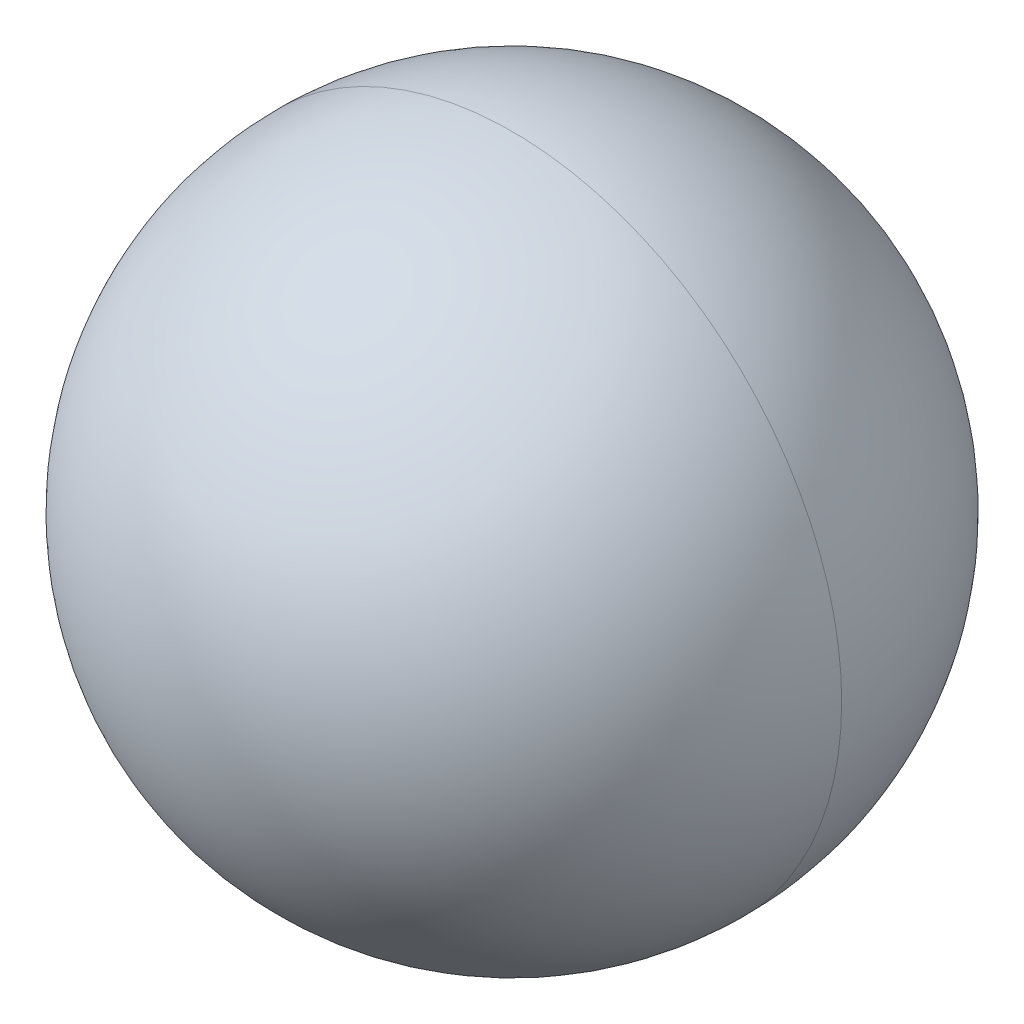
ISO-10303-21;
HEADER;
FILE_DESCRIPTION(('STEP AP214'),'2;1');
FILE_NAME('part.step','',(''),(''),'','','');
FILE_SCHEMA(('AUTOMOTIVE_DESIGN { 1 0 10303 214 1 1 1 1 }'));
ENDSEC;
DATA;
#1=APPLICATION_CONTEXT('core data for automotive mechanical design processes');
#2=APPLICATION_PROTOCOL_DEFINITION('international standard','automotive_design',2000,#1);
#3=PRODUCT_CONTEXT('',#1,'mechanical');
#4=PRODUCT('Part','Part','',(#3));
#5=PRODUCT_RELATED_PRODUCT_CATEGORY('part','',(#4));
#6=PRODUCT_DEFINITION_FORMATION('','',#4);
#7=PRODUCT_DEFINITION_CONTEXT('part definition',#1,'design');
#8=PRODUCT_DEFINITION('design','',#6,#7);
#9=PRODUCT_DEFINITION_SHAPE('','',#8);
#10=(LENGTH_UNIT() NAMED_UNIT(*) SI_UNIT(.MILLI.,.METRE.));
#11=(NAMED_UNIT(*) PLANE_ANGLE_UNIT() SI_UNIT($,.RADIAN.));
#12=(NAMED_UNIT(*) SI_UNIT($,.STERADIAN.) SOLID_ANGLE_UNIT());
#13=UNCERTAINTY_MEASURE_WITH_UNIT(LENGTH_MEASURE(1.E-05),#10,'distance_accuracy_value','');
#14=(GEOMETRIC_REPRESENTATION_CONTEXT(3) GLOBAL_UNCERTAINTY_ASSIGNED_CONTEXT((#13)) GLOBAL_UNIT_ASSIGNED_CONTEXT((#10,
#11,#12)) REPRESENTATION_CONTEXT('',''));
#15=CARTESIAN_POINT('',(0.,0.,0.));
#16=DIRECTION('',(0.,0.,1.));
#17=DIRECTION('',(1.,0.,0.));
#18=AXIS2_PLACEMENT_3D('',#15,#16,#17);
#19=CARTESIAN_POINT('',(6.,14.25,0.));
#20=DIRECTION('',(1.,0.,0.));
#21=DIRECTION('',(0.,0.,1.));
#22=AXIS2_PLACEMENT_3D('',#19,#20,#21);
#23=SPHERICAL_SURFACE('',#22,3.3735);
#24=CARTESIAN_POINT('',(6.,14.25,0.));
#25=DIRECTION('',(0.,0.,-1.));
#26=DIRECTION('',(1.,0.,0.));
#27=AXIS2_PLACEMENT_3D('',#24,#25,#26);
#28=CIRCLE('',#27,3.3735);
#29=CARTESIAN_POINT('',(9.3735,14.25,0.));
#30=VERTEX_POINT('',#29);
#31=CARTESIAN_POINT('',(2.6265,14.25,0.));
#32=VERTEX_POINT('',#31);
#33=EDGE_CURVE('E11',#30,#32,#28,.T.);
#34=ORIENTED_EDGE('',*,*,#33,.T.);
#35=CARTESIAN_POINT('',(6.,14.25,0.));
#36=DIRECTION('',(0.,0.,1.));
#37=DIRECTION('',(1.,0.,0.));
#38=AXIS2_PLACEMENT_3D('',#35,#36,#37);
#39=CIRCLE('',#38,3.3735);
#40=EDGE_CURVE('E25',#30,#32,#39,.T.);
#41=ORIENTED_EDGE('',*,*,#40,.F.);
#42=EDGE_LOOP('',(#34,#41));
#43=FACE_BOUND('',#42,.T.);
#44=ADVANCED_FACE('F17',(#43),#23,.T.);
#45=CARTESIAN_POINT('',(6.,14.25,0.));
#46=DIRECTION('',(1.,0.,0.));
#47=DIRECTION('',(0.,0.,-1.));
#48=AXIS2_PLACEMENT_3D('',#45,#46,#47);
#49=SPHERICAL_SURFACE('',#48,3.3735);
#50=ORIENTED_EDGE('',*,*,#33,.F.);
#51=ORIENTED_EDGE('',*,*,#40,.T.);
#52=EDGE_LOOP('',(#50,#51));
#53=FACE_BOUND('',#52,.T.);
#54=ADVANCED_FACE('F33',(#53),#49,.T.);
#55=CLOSED_SHELL('',(#44,#54));
#56=MANIFOLD_SOLID_BREP('B1',#55);
#57=ADVANCED_BREP_SHAPE_REPRESENTATION('',(#18,#56),#14);
#58=SHAPE_DEFINITION_REPRESENTATION(#9,#57);
ENDSEC;
END-ISO-10303-21;
